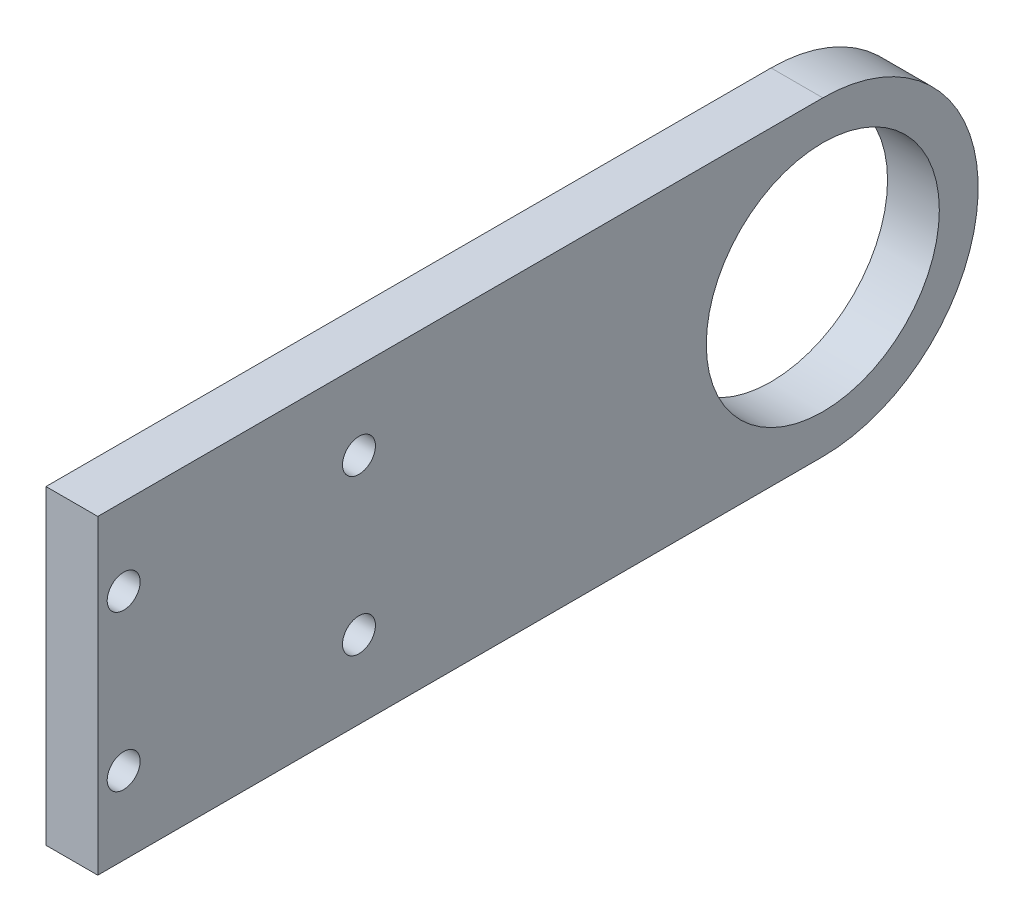
ISO-10303-21;
HEADER;
FILE_DESCRIPTION(('STEP AP214'),'2;1');
FILE_NAME('part.step','',(''),(''),'','','');
FILE_SCHEMA(('AUTOMOTIVE_DESIGN { 1 0 10303 214 1 1 1 1 }'));
ENDSEC;
DATA;
#1=APPLICATION_CONTEXT('core data for automotive mechanical design processes');
#2=APPLICATION_PROTOCOL_DEFINITION('international standard','automotive_design',2000,#1);
#3=PRODUCT_CONTEXT('',#1,'mechanical');
#4=PRODUCT('Part','Part','',(#3));
#5=PRODUCT_RELATED_PRODUCT_CATEGORY('part','',(#4));
#6=PRODUCT_DEFINITION_FORMATION('','',#4);
#7=PRODUCT_DEFINITION_CONTEXT('part definition',#1,'design');
#8=PRODUCT_DEFINITION('design','',#6,#7);
#9=PRODUCT_DEFINITION_SHAPE('','',#8);
#10=(LENGTH_UNIT() NAMED_UNIT(*) SI_UNIT(.MILLI.,.METRE.));
#11=(NAMED_UNIT(*) PLANE_ANGLE_UNIT() SI_UNIT($,.RADIAN.));
#12=(NAMED_UNIT(*) SI_UNIT($,.STERADIAN.) SOLID_ANGLE_UNIT());
#13=UNCERTAINTY_MEASURE_WITH_UNIT(LENGTH_MEASURE(1.E-05),#10,'distance_accuracy_value','');
#14=(GEOMETRIC_REPRESENTATION_CONTEXT(3) GLOBAL_UNCERTAINTY_ASSIGNED_CONTEXT((#13)) GLOBAL_UNIT_ASSIGNED_CONTEXT((#10,
#11,#12)) REPRESENTATION_CONTEXT('',''));
#15=CARTESIAN_POINT('',(0.,0.,0.));
#16=DIRECTION('',(0.,0.,1.));
#17=DIRECTION('',(1.,0.,0.));
#18=AXIS2_PLACEMENT_3D('',#15,#16,#17);
#19=CARTESIAN_POINT('',(6.35,0.,-88.9));
#20=DIRECTION('',(1.,0.,0.));
#21=DIRECTION('',(0.,0.,-1.));
#22=AXIS2_PLACEMENT_3D('',#19,#20,#21);
#23=PLANE('',#22);
#24=CARTESIAN_POINT('',(6.35,-9.52500000000001,-32.025));
#25=DIRECTION('',(1.,0.,0.));
#26=DIRECTION('',(0.,0.,-1.));
#27=AXIS2_PLACEMENT_3D('',#24,#25,#26);
#28=CIRCLE('',#27,2.01930000000001);
#29=CARTESIAN_POINT('',(6.35,-9.52500000000001,-34.0443));
#30=VERTEX_POINT('',#29);
#31=EDGE_CURVE('E126',#30,#30,#28,.T.);
#32=ORIENTED_EDGE('',*,*,#31,.F.);
#33=EDGE_LOOP('',(#32));
#34=FACE_BOUND('',#33,.T.);
#35=CARTESIAN_POINT('',(6.35,-9.52500000000001,-3.17499999999999));
#36=DIRECTION('',(1.,0.,0.));
#37=DIRECTION('',(0.,0.,-1.));
#38=AXIS2_PLACEMENT_3D('',#35,#36,#37);
#39=CIRCLE('',#38,2.0193);
#40=CARTESIAN_POINT('',(6.35,-9.52500000000001,-5.19429999999999));
#41=VERTEX_POINT('',#40);
#42=EDGE_CURVE('E114',#41,#41,#39,.T.);
#43=ORIENTED_EDGE('',*,*,#42,.F.);
#44=EDGE_LOOP('',(#43));
#45=FACE_BOUND('',#44,.T.);
#46=DIRECTION('',(0.,0.,1.));
#47=VECTOR('',#46,1.);
#48=CARTESIAN_POINT('',(6.35,19.05,0.));
#49=LINE('',#48,#47);
#50=CARTESIAN_POINT('',(6.35,19.05,-88.9));
#51=VERTEX_POINT('',#50);
#52=CARTESIAN_POINT('',(6.35,19.05,0.));
#53=VERTEX_POINT('',#52);
#54=EDGE_CURVE('E84',#51,#53,#49,.T.);
#55=ORIENTED_EDGE('',*,*,#54,.T.);
#56=DIRECTION('',(0.,-1.,0.));
#57=VECTOR('',#56,1.);
#58=CARTESIAN_POINT('',(6.35,19.05,0.));
#59=LINE('',#58,#57);
#60=CARTESIAN_POINT('',(6.35,-19.05,0.));
#61=VERTEX_POINT('',#60);
#62=EDGE_CURVE('E79',#53,#61,#59,.T.);
#63=ORIENTED_EDGE('',*,*,#62,.T.);
#64=DIRECTION('',(0.,0.,-1.));
#65=VECTOR('',#64,1.);
#66=CARTESIAN_POINT('',(6.35,-19.05,0.));
#67=LINE('',#66,#65);
#68=CARTESIAN_POINT('',(6.35,-19.05,-88.9));
#69=VERTEX_POINT('',#68);
#70=EDGE_CURVE('E82',#61,#69,#67,.T.);
#71=ORIENTED_EDGE('',*,*,#70,.T.);
#72=CARTESIAN_POINT('',(6.35,0.,-88.9));
#73=DIRECTION('',(1.,0.,0.));
#74=DIRECTION('',(0.,0.,-1.));
#75=AXIS2_PLACEMENT_3D('',#72,#73,#74);
#76=CIRCLE('',#75,19.05);
#77=EDGE_CURVE('E49',#69,#51,#76,.T.);
#78=ORIENTED_EDGE('',*,*,#77,.T.);
#79=EDGE_LOOP('',(#55,#63,#71,#78));
#80=FACE_BOUND('',#79,.T.);
#81=CARTESIAN_POINT('',(6.35,0.,-88.9));
#82=DIRECTION('',(1.,0.,0.));
#83=DIRECTION('',(0.,0.,-1.));
#84=AXIS2_PLACEMENT_3D('',#81,#82,#83);
#85=CIRCLE('',#84,14.2875);
#86=CARTESIAN_POINT('',(6.35,0.,-103.1875));
#87=VERTEX_POINT('',#86);
#88=EDGE_CURVE('E99',#87,#87,#85,.T.);
#89=ORIENTED_EDGE('',*,*,#88,.F.);
#90=EDGE_LOOP('',(#89));
#91=FACE_BOUND('',#90,.T.);
#92=CARTESIAN_POINT('',(6.35,9.525,-3.17499999999999));
#93=DIRECTION('',(1.,0.,0.));
#94=DIRECTION('',(0.,0.,-1.));
#95=AXIS2_PLACEMENT_3D('',#92,#93,#94);
#96=CIRCLE('',#95,2.0193);
#97=CARTESIAN_POINT('',(6.35,9.525,-5.19429999999999));
#98=VERTEX_POINT('',#97);
#99=EDGE_CURVE('E120',#98,#98,#96,.T.);
#100=ORIENTED_EDGE('',*,*,#99,.F.);
#101=EDGE_LOOP('',(#100));
#102=FACE_BOUND('',#101,.T.);
#103=CARTESIAN_POINT('',(6.35,9.52500000000001,-32.025));
#104=DIRECTION('',(1.,0.,0.));
#105=DIRECTION('',(0.,0.,-1.));
#106=AXIS2_PLACEMENT_3D('',#103,#104,#105);
#107=CIRCLE('',#106,2.01930000000001);
#108=CARTESIAN_POINT('',(6.35,9.52500000000001,-34.0443));
#109=VERTEX_POINT('',#108);
#110=EDGE_CURVE('E132',#109,#109,#107,.T.);
#111=ORIENTED_EDGE('',*,*,#110,.F.);
#112=EDGE_LOOP('',(#111));
#113=FACE_BOUND('',#112,.T.);
#114=ADVANCED_FACE('F32',(#34,#45,#80,#91,#102,#113),#23,.T.);
#115=CARTESIAN_POINT('',(0.,0.,-88.9));
#116=DIRECTION('',(1.,0.,0.));
#117=DIRECTION('',(0.,0.,-1.));
#118=AXIS2_PLACEMENT_3D('',#115,#116,#117);
#119=PLANE('',#118);
#120=DIRECTION('',(0.,0.,1.));
#121=VECTOR('',#120,1.);
#122=CARTESIAN_POINT('',(0.,19.05,0.));
#123=LINE('',#122,#121);
#124=CARTESIAN_POINT('',(0.,19.05,-88.9));
#125=VERTEX_POINT('',#124);
#126=CARTESIAN_POINT('',(0.,19.05,0.));
#127=VERTEX_POINT('',#126);
#128=EDGE_CURVE('E96',#125,#127,#123,.T.);
#129=ORIENTED_EDGE('',*,*,#128,.F.);
#130=CARTESIAN_POINT('',(0.,0.,-88.9));
#131=DIRECTION('',(1.,0.,0.));
#132=DIRECTION('',(0.,0.,-1.));
#133=AXIS2_PLACEMENT_3D('',#130,#131,#132);
#134=CIRCLE('',#133,19.05);
#135=CARTESIAN_POINT('',(0.,-19.05,-88.9));
#136=VERTEX_POINT('',#135);
#137=EDGE_CURVE('E72',#136,#125,#134,.T.);
#138=ORIENTED_EDGE('',*,*,#137,.F.);
#139=DIRECTION('',(0.,0.,-1.));
#140=VECTOR('',#139,1.);
#141=CARTESIAN_POINT('',(0.,-19.05,0.));
#142=LINE('',#141,#140);
#143=CARTESIAN_POINT('',(0.,-19.05,0.));
#144=VERTEX_POINT('',#143);
#145=EDGE_CURVE('E66',#144,#136,#142,.T.);
#146=ORIENTED_EDGE('',*,*,#145,.F.);
#147=DIRECTION('',(0.,-1.,0.));
#148=VECTOR('',#147,1.);
#149=CARTESIAN_POINT('',(0.,19.05,0.));
#150=LINE('',#149,#148);
#151=EDGE_CURVE('E88',#127,#144,#150,.T.);
#152=ORIENTED_EDGE('',*,*,#151,.F.);
#153=EDGE_LOOP('',(#129,#138,#146,#152));
#154=FACE_BOUND('',#153,.T.);
#155=CARTESIAN_POINT('',(0.,0.,-88.9));
#156=DIRECTION('',(1.,0.,0.));
#157=DIRECTION('',(0.,0.,-1.));
#158=AXIS2_PLACEMENT_3D('',#155,#156,#157);
#159=CIRCLE('',#158,14.2875);
#160=CARTESIAN_POINT('',(0.,0.,-103.1875));
#161=VERTEX_POINT('',#160);
#162=EDGE_CURVE('E111',#161,#161,#159,.T.);
#163=ORIENTED_EDGE('',*,*,#162,.T.);
#164=EDGE_LOOP('',(#163));
#165=FACE_BOUND('',#164,.T.);
#166=CARTESIAN_POINT('',(0.,-9.52500000000001,-3.17499999999999));
#167=DIRECTION('',(1.,0.,0.));
#168=DIRECTION('',(0.,0.,-1.));
#169=AXIS2_PLACEMENT_3D('',#166,#167,#168);
#170=CIRCLE('',#169,2.0193);
#171=CARTESIAN_POINT('',(0.,-9.52500000000001,-5.19429999999999));
#172=VERTEX_POINT('',#171);
#173=EDGE_CURVE('E117',#172,#172,#170,.T.);
#174=ORIENTED_EDGE('',*,*,#173,.T.);
#175=EDGE_LOOP('',(#174));
#176=FACE_BOUND('',#175,.T.);
#177=CARTESIAN_POINT('',(0.,9.525,-3.17499999999999));
#178=DIRECTION('',(1.,0.,0.));
#179=DIRECTION('',(0.,0.,-1.));
#180=AXIS2_PLACEMENT_3D('',#177,#178,#179);
#181=CIRCLE('',#180,2.0193);
#182=CARTESIAN_POINT('',(0.,9.525,-5.19429999999999));
#183=VERTEX_POINT('',#182);
#184=EDGE_CURVE('E123',#183,#183,#181,.T.);
#185=ORIENTED_EDGE('',*,*,#184,.T.);
#186=EDGE_LOOP('',(#185));
#187=FACE_BOUND('',#186,.T.);
#188=CARTESIAN_POINT('',(0.,-9.52500000000001,-32.025));
#189=DIRECTION('',(1.,0.,0.));
#190=DIRECTION('',(0.,0.,-1.));
#191=AXIS2_PLACEMENT_3D('',#188,#189,#190);
#192=CIRCLE('',#191,2.01930000000001);
#193=CARTESIAN_POINT('',(0.,-9.52500000000001,-34.0443));
#194=VERTEX_POINT('',#193);
#195=EDGE_CURVE('E129',#194,#194,#192,.T.);
#196=ORIENTED_EDGE('',*,*,#195,.T.);
#197=EDGE_LOOP('',(#196));
#198=FACE_BOUND('',#197,.T.);
#199=CARTESIAN_POINT('',(0.,9.52500000000001,-32.025));
#200=DIRECTION('',(1.,0.,0.));
#201=DIRECTION('',(0.,0.,-1.));
#202=AXIS2_PLACEMENT_3D('',#199,#200,#201);
#203=CIRCLE('',#202,2.01930000000001);
#204=CARTESIAN_POINT('',(0.,9.52500000000001,-34.0443));
#205=VERTEX_POINT('',#204);
#206=EDGE_CURVE('E135',#205,#205,#203,.T.);
#207=ORIENTED_EDGE('',*,*,#206,.T.);
#208=EDGE_LOOP('',(#207));
#209=FACE_BOUND('',#208,.T.);
#210=ADVANCED_FACE('F107',(#154,#165,#176,#187,#198,#209),#119,.F.);
#211=CARTESIAN_POINT('',(6.35,19.05,0.));
#212=DIRECTION('',(0.,-1.,0.));
#213=DIRECTION('',(0.,0.,-1.));
#214=AXIS2_PLACEMENT_3D('',#211,#212,#213);
#215=PLANE('',#214);
#216=ORIENTED_EDGE('',*,*,#128,.T.);
#217=DIRECTION('',(-1.,0.,0.));
#218=VECTOR('',#217,1.);
#219=CARTESIAN_POINT('',(6.35,19.05,0.));
#220=LINE('',#219,#218);
#221=EDGE_CURVE('E11',#53,#127,#220,.T.);
#222=ORIENTED_EDGE('',*,*,#221,.F.);
#223=ORIENTED_EDGE('',*,*,#54,.F.);
#224=DIRECTION('',(-1.,0.,0.));
#225=VECTOR('',#224,1.);
#226=CARTESIAN_POINT('',(6.35,19.05,-88.9));
#227=LINE('',#226,#225);
#228=EDGE_CURVE('E92',#51,#125,#227,.T.);
#229=ORIENTED_EDGE('',*,*,#228,.T.);
#230=EDGE_LOOP('',(#216,#222,#223,#229));
#231=FACE_BOUND('',#230,.T.);
#232=ADVANCED_FACE('F34',(#231),#215,.F.);
#233=CARTESIAN_POINT('',(6.35,19.05,0.));
#234=DIRECTION('',(0.,0.,-1.));
#235=DIRECTION('',(-1.,0.,0.));
#236=AXIS2_PLACEMENT_3D('',#233,#234,#235);
#237=PLANE('',#236);
#238=ORIENTED_EDGE('',*,*,#151,.T.);
#239=DIRECTION('',(-1.,0.,0.));
#240=VECTOR('',#239,1.);
#241=CARTESIAN_POINT('',(6.35,-19.05,0.));
#242=LINE('',#241,#240);
#243=EDGE_CURVE('E41',#61,#144,#242,.T.);
#244=ORIENTED_EDGE('',*,*,#243,.F.);
#245=ORIENTED_EDGE('',*,*,#62,.F.);
#246=ORIENTED_EDGE('',*,*,#221,.T.);
#247=EDGE_LOOP('',(#238,#244,#245,#246));
#248=FACE_BOUND('',#247,.T.);
#249=ADVANCED_FACE('F87',(#248),#237,.F.);
#250=CARTESIAN_POINT('',(6.35,-19.05,0.));
#251=DIRECTION('',(0.,1.,0.));
#252=DIRECTION('',(0.,0.,1.));
#253=AXIS2_PLACEMENT_3D('',#250,#251,#252);
#254=PLANE('',#253);
#255=ORIENTED_EDGE('',*,*,#145,.T.);
#256=DIRECTION('',(-1.,0.,0.));
#257=VECTOR('',#256,1.);
#258=CARTESIAN_POINT('',(6.35,-19.05,-88.9));
#259=LINE('',#258,#257);
#260=EDGE_CURVE('E89',#69,#136,#259,.T.);
#261=ORIENTED_EDGE('',*,*,#260,.F.);
#262=ORIENTED_EDGE('',*,*,#70,.F.);
#263=ORIENTED_EDGE('',*,*,#243,.T.);
#264=EDGE_LOOP('',(#255,#261,#262,#263));
#265=FACE_BOUND('',#264,.T.);
#266=ADVANCED_FACE('F90',(#265),#254,.F.);
#267=CARTESIAN_POINT('',(6.35,0.,-88.9));
#268=DIRECTION('',(-1.,0.,0.));
#269=DIRECTION('',(0.,0.,1.));
#270=AXIS2_PLACEMENT_3D('',#267,#268,#269);
#271=CYLINDRICAL_SURFACE('',#270,19.05);
#272=ORIENTED_EDGE('',*,*,#137,.T.);
#273=ORIENTED_EDGE('',*,*,#228,.F.);
#274=ORIENTED_EDGE('',*,*,#77,.F.);
#275=ORIENTED_EDGE('',*,*,#260,.T.);
#276=EDGE_LOOP('',(#272,#273,#274,#275));
#277=FACE_BOUND('',#276,.T.);
#278=ADVANCED_FACE('F104',(#277),#271,.T.);
#279=CARTESIAN_POINT('',(6.35,0.,-88.9));
#280=DIRECTION('',(-1.,0.,0.));
#281=DIRECTION('',(0.,0.,1.));
#282=AXIS2_PLACEMENT_3D('',#279,#280,#281);
#283=CYLINDRICAL_SURFACE('',#282,14.2875);
#284=ORIENTED_EDGE('',*,*,#88,.T.);
#285=EDGE_LOOP('',(#284));
#286=FACE_BOUND('',#285,.T.);
#287=ORIENTED_EDGE('',*,*,#162,.F.);
#288=EDGE_LOOP('',(#287));
#289=FACE_BOUND('',#288,.T.);
#290=ADVANCED_FACE('F154',(#286,#289),#283,.F.);
#291=CARTESIAN_POINT('',(6.35,-9.52500000000001,-3.17499999999999));
#292=DIRECTION('',(-1.,0.,0.));
#293=DIRECTION('',(0.,0.,1.));
#294=AXIS2_PLACEMENT_3D('',#291,#292,#293);
#295=CYLINDRICAL_SURFACE('',#294,2.0193);
#296=ORIENTED_EDGE('',*,*,#42,.T.);
#297=EDGE_LOOP('',(#296));
#298=FACE_BOUND('',#297,.T.);
#299=ORIENTED_EDGE('',*,*,#173,.F.);
#300=EDGE_LOOP('',(#299));
#301=FACE_BOUND('',#300,.T.);
#302=ADVANCED_FACE('F200',(#298,#301),#295,.F.);
#303=CARTESIAN_POINT('',(6.35,9.525,-3.17499999999999));
#304=DIRECTION('',(-1.,0.,0.));
#305=DIRECTION('',(0.,0.,1.));
#306=AXIS2_PLACEMENT_3D('',#303,#304,#305);
#307=CYLINDRICAL_SURFACE('',#306,2.0193);
#308=ORIENTED_EDGE('',*,*,#99,.T.);
#309=EDGE_LOOP('',(#308));
#310=FACE_BOUND('',#309,.T.);
#311=ORIENTED_EDGE('',*,*,#184,.F.);
#312=EDGE_LOOP('',(#311));
#313=FACE_BOUND('',#312,.T.);
#314=ADVANCED_FACE('F208',(#310,#313),#307,.F.);
#315=CARTESIAN_POINT('',(6.35,-9.52500000000001,-32.025));
#316=DIRECTION('',(-1.,0.,0.));
#317=DIRECTION('',(0.,0.,1.));
#318=AXIS2_PLACEMENT_3D('',#315,#316,#317);
#319=CYLINDRICAL_SURFACE('',#318,2.01930000000001);
#320=ORIENTED_EDGE('',*,*,#31,.T.);
#321=EDGE_LOOP('',(#320));
#322=FACE_BOUND('',#321,.T.);
#323=ORIENTED_EDGE('',*,*,#195,.F.);
#324=EDGE_LOOP('',(#323));
#325=FACE_BOUND('',#324,.T.);
#326=ADVANCED_FACE('F216',(#322,#325),#319,.F.);
#327=CARTESIAN_POINT('',(6.35,9.52500000000001,-32.025));
#328=DIRECTION('',(-1.,0.,0.));
#329=DIRECTION('',(0.,0.,1.));
#330=AXIS2_PLACEMENT_3D('',#327,#328,#329);
#331=CYLINDRICAL_SURFACE('',#330,2.01930000000001);
#332=ORIENTED_EDGE('',*,*,#110,.T.);
#333=EDGE_LOOP('',(#332));
#334=FACE_BOUND('',#333,.T.);
#335=ORIENTED_EDGE('',*,*,#206,.F.);
#336=EDGE_LOOP('',(#335));
#337=FACE_BOUND('',#336,.T.);
#338=ADVANCED_FACE('F141',(#334,#337),#331,.F.);
#339=CLOSED_SHELL('',(#114,#210,#232,#249,#266,#278,#290,#302,#314,#326,#338));
#340=MANIFOLD_SOLID_BREP('B2',#339);
#341=ADVANCED_BREP_SHAPE_REPRESENTATION('',(#18,#340),#14);
#342=SHAPE_DEFINITION_REPRESENTATION(#9,#341);
ENDSEC;
END-ISO-10303-21;
